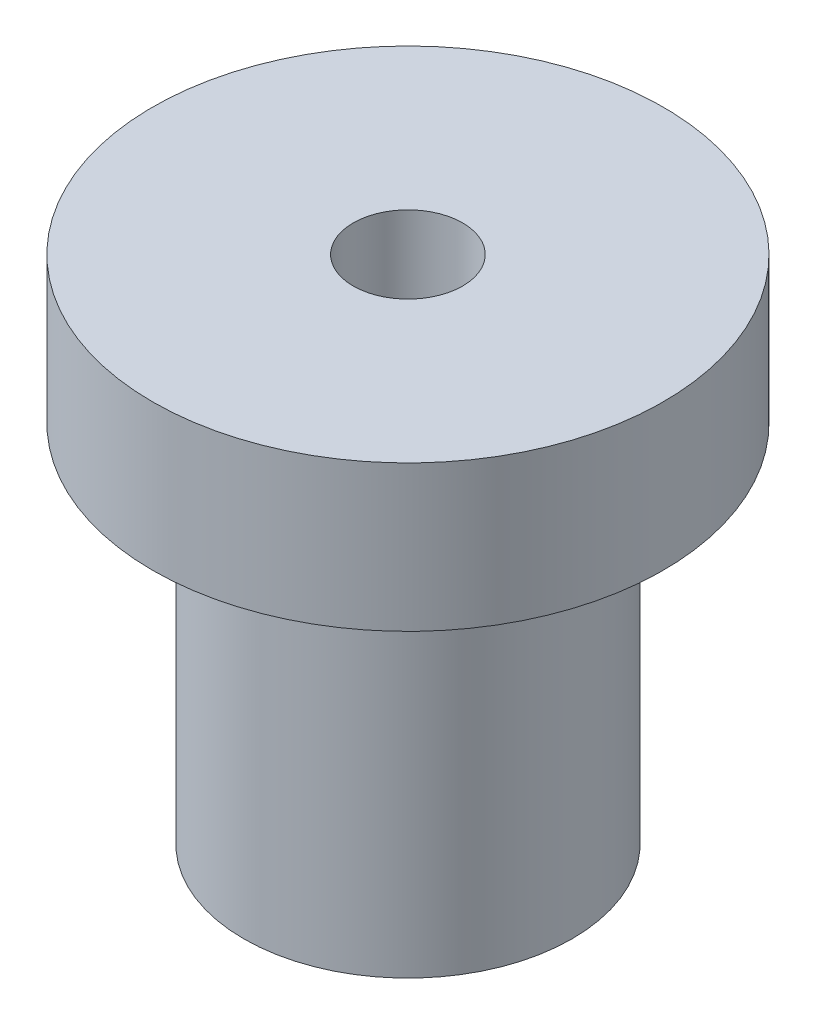
ISO-10303-21;
HEADER;
FILE_DESCRIPTION(('STEP AP214'),'2;1');
FILE_NAME('part.step','',(''),(''),'','','');
FILE_SCHEMA(('AUTOMOTIVE_DESIGN { 1 0 10303 214 1 1 1 1 }'));
ENDSEC;
DATA;
#1=APPLICATION_CONTEXT('core data for automotive mechanical design processes');
#2=APPLICATION_PROTOCOL_DEFINITION('international standard','automotive_design',2000,#1);
#3=PRODUCT_CONTEXT('',#1,'mechanical');
#4=PRODUCT('Part','Part','',(#3));
#5=PRODUCT_RELATED_PRODUCT_CATEGORY('part','',(#4));
#6=PRODUCT_DEFINITION_FORMATION('','',#4);
#7=PRODUCT_DEFINITION_CONTEXT('part definition',#1,'design');
#8=PRODUCT_DEFINITION('design','',#6,#7);
#9=PRODUCT_DEFINITION_SHAPE('','',#8);
#10=(LENGTH_UNIT() NAMED_UNIT(*) SI_UNIT(.MILLI.,.METRE.));
#11=(NAMED_UNIT(*) PLANE_ANGLE_UNIT() SI_UNIT($,.RADIAN.));
#12=(NAMED_UNIT(*) SI_UNIT($,.STERADIAN.) SOLID_ANGLE_UNIT());
#13=UNCERTAINTY_MEASURE_WITH_UNIT(LENGTH_MEASURE(1.E-05),#10,'distance_accuracy_value','');
#14=(GEOMETRIC_REPRESENTATION_CONTEXT(3) GLOBAL_UNCERTAINTY_ASSIGNED_CONTEXT((#13)) GLOBAL_UNIT_ASSIGNED_CONTEXT((#10,
#11,#12)) REPRESENTATION_CONTEXT('',''));
#15=CARTESIAN_POINT('',(0.,0.,0.));
#16=DIRECTION('',(0.,0.,1.));
#17=DIRECTION('',(1.,0.,0.));
#18=AXIS2_PLACEMENT_3D('',#15,#16,#17);
#19=CARTESIAN_POINT('',(0.,20.,0.));
#20=DIRECTION('',(0.,-1.,0.));
#21=DIRECTION('',(0.,0.,-1.));
#22=AXIS2_PLACEMENT_3D('',#19,#20,#21);
#23=CYLINDRICAL_SURFACE('',#22,9.);
#24=CARTESIAN_POINT('',(0.,20.,0.));
#25=DIRECTION('',(0.,1.,0.));
#26=DIRECTION('',(0.,0.,1.));
#27=AXIS2_PLACEMENT_3D('',#24,#25,#26);
#28=CIRCLE('',#27,9.);
#29=CARTESIAN_POINT('',(0.,20.,9.));
#30=VERTEX_POINT('',#29);
#31=EDGE_CURVE('E10',#30,#30,#28,.T.);
#32=ORIENTED_EDGE('',*,*,#31,.F.);
#33=EDGE_LOOP('',(#32));
#34=FACE_BOUND('',#33,.T.);
#35=CARTESIAN_POINT('',(0.,0.,0.));
#36=DIRECTION('',(0.,1.,0.));
#37=DIRECTION('',(0.,0.,1.));
#38=AXIS2_PLACEMENT_3D('',#35,#36,#37);
#39=CIRCLE('',#38,9.);
#40=CARTESIAN_POINT('',(0.,0.,9.));
#41=VERTEX_POINT('',#40);
#42=EDGE_CURVE('E33',#41,#41,#39,.T.);
#43=ORIENTED_EDGE('',*,*,#42,.T.);
#44=EDGE_LOOP('',(#43));
#45=FACE_BOUND('',#44,.T.);
#46=ADVANCED_FACE('F30',(#34,#45),#23,.T.);
#47=CARTESIAN_POINT('',(0.,0.,0.));
#48=DIRECTION('',(0.,1.,0.));
#49=DIRECTION('',(0.,0.,1.));
#50=AXIS2_PLACEMENT_3D('',#47,#48,#49);
#51=PLANE('',#50);
#52=CARTESIAN_POINT('',(0.,0.,0.));
#53=DIRECTION('',(0.,-1.,0.));
#54=DIRECTION('',(0.,0.,-1.));
#55=AXIS2_PLACEMENT_3D('',#52,#53,#54);
#56=CIRCLE('',#55,3.);
#57=CARTESIAN_POINT('',(0.,0.,-3.));
#58=VERTEX_POINT('',#57);
#59=EDGE_CURVE('E40',#58,#58,#56,.T.);
#60=ORIENTED_EDGE('',*,*,#59,.F.);
#61=EDGE_LOOP('',(#60));
#62=FACE_BOUND('',#61,.T.);
#63=ORIENTED_EDGE('',*,*,#42,.F.);
#64=EDGE_LOOP('',(#63));
#65=FACE_BOUND('',#64,.T.);
#66=ADVANCED_FACE('F75',(#62,#65),#51,.F.);
#67=CARTESIAN_POINT('',(0.,52.,0.));
#68=DIRECTION('',(0.,-1.,0.));
#69=DIRECTION('',(0.,0.,-1.));
#70=AXIS2_PLACEMENT_3D('',#67,#68,#69);
#71=CYLINDRICAL_SURFACE('',#70,3.);
#72=CARTESIAN_POINT('',(0.,28.,0.));
#73=DIRECTION('',(0.,1.,0.));
#74=DIRECTION('',(0.,0.,1.));
#75=AXIS2_PLACEMENT_3D('',#72,#73,#74);
#76=CIRCLE('',#75,3.);
#77=CARTESIAN_POINT('',(0.,28.,3.));
#78=VERTEX_POINT('',#77);
#79=EDGE_CURVE('E48',#78,#78,#76,.T.);
#80=ORIENTED_EDGE('',*,*,#79,.T.);
#81=EDGE_LOOP('',(#80));
#82=FACE_BOUND('',#81,.T.);
#83=ORIENTED_EDGE('',*,*,#59,.T.);
#84=EDGE_LOOP('',(#83));
#85=FACE_BOUND('',#84,.T.);
#86=ADVANCED_FACE('F54',(#82,#85),#71,.F.);
#87=CARTESIAN_POINT('',(0.,20.,0.));
#88=DIRECTION('',(0.,1.,0.));
#89=DIRECTION('',(0.,0.,1.));
#90=AXIS2_PLACEMENT_3D('',#87,#88,#89);
#91=PLANE('',#90);
#92=ORIENTED_EDGE('',*,*,#31,.T.);
#93=EDGE_LOOP('',(#92));
#94=FACE_BOUND('',#93,.T.);
#95=CARTESIAN_POINT('',(0.,20.,0.));
#96=DIRECTION('',(0.,1.,0.));
#97=DIRECTION('',(0.,0.,1.));
#98=AXIS2_PLACEMENT_3D('',#95,#96,#97);
#99=CIRCLE('',#98,14.);
#100=CARTESIAN_POINT('',(0.,20.,14.));
#101=VERTEX_POINT('',#100);
#102=EDGE_CURVE('E45',#101,#101,#99,.T.);
#103=ORIENTED_EDGE('',*,*,#102,.F.);
#104=EDGE_LOOP('',(#103));
#105=FACE_BOUND('',#104,.T.);
#106=ADVANCED_FACE('F61',(#94,#105),#91,.F.);
#107=CARTESIAN_POINT('',(0.,28.,0.));
#108=DIRECTION('',(0.,1.,0.));
#109=DIRECTION('',(0.,0.,1.));
#110=AXIS2_PLACEMENT_3D('',#107,#108,#109);
#111=PLANE('',#110);
#112=ORIENTED_EDGE('',*,*,#79,.F.);
#113=EDGE_LOOP('',(#112));
#114=FACE_BOUND('',#113,.T.);
#115=CARTESIAN_POINT('',(0.,28.,0.));
#116=DIRECTION('',(0.,1.,0.));
#117=DIRECTION('',(0.,0.,1.));
#118=AXIS2_PLACEMENT_3D('',#115,#116,#117);
#119=CIRCLE('',#118,14.);
#120=CARTESIAN_POINT('',(0.,28.,14.));
#121=VERTEX_POINT('',#120);
#122=EDGE_CURVE('E44',#121,#121,#119,.T.);
#123=ORIENTED_EDGE('',*,*,#122,.T.);
#124=EDGE_LOOP('',(#123));
#125=FACE_BOUND('',#124,.T.);
#126=ADVANCED_FACE('F57',(#114,#125),#111,.T.);
#127=CARTESIAN_POINT('',(0.,28.,0.));
#128=DIRECTION('',(0.,-1.,0.));
#129=DIRECTION('',(0.,0.,-1.));
#130=AXIS2_PLACEMENT_3D('',#127,#128,#129);
#131=CYLINDRICAL_SURFACE('',#130,14.);
#132=ORIENTED_EDGE('',*,*,#122,.F.);
#133=EDGE_LOOP('',(#132));
#134=FACE_BOUND('',#133,.T.);
#135=ORIENTED_EDGE('',*,*,#102,.T.);
#136=EDGE_LOOP('',(#135));
#137=FACE_BOUND('',#136,.T.);
#138=ADVANCED_FACE('F60',(#134,#137),#131,.T.);
#139=CLOSED_SHELL('',(#46,#66,#86,#106,#126,#138));
#140=MANIFOLD_SOLID_BREP('B2',#139);
#141=ADVANCED_BREP_SHAPE_REPRESENTATION('',(#18,#140),#14);
#142=SHAPE_DEFINITION_REPRESENTATION(#9,#141);
ENDSEC;
END-ISO-10303-21;
